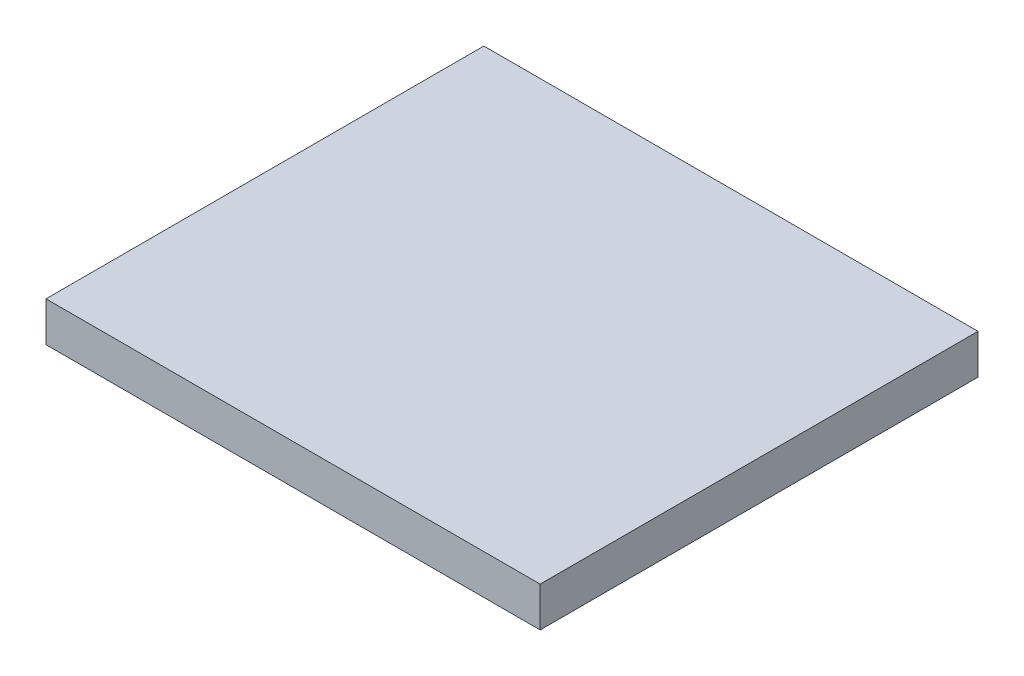
ISO-10303-21;
HEADER;
FILE_DESCRIPTION(('STEP AP214'),'2;1');
FILE_NAME('part.step','',(''),(''),'','','');
FILE_SCHEMA(('AUTOMOTIVE_DESIGN { 1 0 10303 214 1 1 1 1 }'));
ENDSEC;
DATA;
#1=APPLICATION_CONTEXT('core data for automotive mechanical design processes');
#2=APPLICATION_PROTOCOL_DEFINITION('international standard','automotive_design',2000,#1);
#3=PRODUCT_CONTEXT('',#1,'mechanical');
#4=PRODUCT('Part','Part','',(#3));
#5=PRODUCT_RELATED_PRODUCT_CATEGORY('part','',(#4));
#6=PRODUCT_DEFINITION_FORMATION('','',#4);
#7=PRODUCT_DEFINITION_CONTEXT('part definition',#1,'design');
#8=PRODUCT_DEFINITION('design','',#6,#7);
#9=PRODUCT_DEFINITION_SHAPE('','',#8);
#10=(LENGTH_UNIT() NAMED_UNIT(*) SI_UNIT(.MILLI.,.METRE.));
#11=(NAMED_UNIT(*) PLANE_ANGLE_UNIT() SI_UNIT($,.RADIAN.));
#12=(NAMED_UNIT(*) SI_UNIT($,.STERADIAN.) SOLID_ANGLE_UNIT());
#13=UNCERTAINTY_MEASURE_WITH_UNIT(LENGTH_MEASURE(1.E-05),#10,'distance_accuracy_value','');
#14=(GEOMETRIC_REPRESENTATION_CONTEXT(3) GLOBAL_UNCERTAINTY_ASSIGNED_CONTEXT((#13)) GLOBAL_UNIT_ASSIGNED_CONTEXT((#10,
#11,#12)) REPRESENTATION_CONTEXT('',''));
#15=CARTESIAN_POINT('',(0.,0.,0.));
#16=DIRECTION('',(0.,0.,1.));
#17=DIRECTION('',(1.,0.,0.));
#18=AXIS2_PLACEMENT_3D('',#15,#16,#17);
#19=CARTESIAN_POINT('',(-43.5628937256313,3.175,-5.71090549510746));
#20=DIRECTION('',(1.,0.,0.));
#21=DIRECTION('',(0.,0.,-1.));
#22=AXIS2_PLACEMENT_3D('',#19,#20,#21);
#23=PLANE('',#22);
#24=DIRECTION('',(0.,0.,1.));
#25=VECTOR('',#24,1.);
#26=CARTESIAN_POINT('',(-43.5628937256313,0.,-5.71090549510746));
#27=LINE('',#26,#25);
#28=CARTESIAN_POINT('',(-43.5628937256313,0.,-5.71090549510746));
#29=VERTEX_POINT('',#28);
#30=CARTESIAN_POINT('',(-43.5628937256313,0.,29.2890945048925));
#31=VERTEX_POINT('',#30);
#32=EDGE_CURVE('E96',#29,#31,#27,.T.);
#33=ORIENTED_EDGE('',*,*,#32,.T.);
#34=DIRECTION('',(0.,-1.,0.));
#35=VECTOR('',#34,1.);
#36=CARTESIAN_POINT('',(-43.5628937256313,3.175,29.2890945048925));
#37=LINE('',#36,#35);
#38=CARTESIAN_POINT('',(-43.5628937256313,3.175,29.2890945048925));
#39=VERTEX_POINT('',#38);
#40=EDGE_CURVE('E11',#39,#31,#37,.T.);
#41=ORIENTED_EDGE('',*,*,#40,.F.);
#42=DIRECTION('',(0.,0.,1.));
#43=VECTOR('',#42,1.);
#44=CARTESIAN_POINT('',(-43.5628937256313,3.175,-5.71090549510746));
#45=LINE('',#44,#43);
#46=CARTESIAN_POINT('',(-43.5628937256313,3.175,-5.71090549510746));
#47=VERTEX_POINT('',#46);
#48=EDGE_CURVE('E84',#47,#39,#45,.T.);
#49=ORIENTED_EDGE('',*,*,#48,.F.);
#50=DIRECTION('',(0.,-1.,0.));
#51=VECTOR('',#50,1.);
#52=CARTESIAN_POINT('',(-43.5628937256313,3.175,-5.71090549510746));
#53=LINE('',#52,#51);
#54=EDGE_CURVE('E92',#47,#29,#53,.T.);
#55=ORIENTED_EDGE('',*,*,#54,.T.);
#56=EDGE_LOOP('',(#33,#41,#49,#55));
#57=FACE_BOUND('',#56,.T.);
#58=ADVANCED_FACE('F33',(#57),#23,.F.);
#59=CARTESIAN_POINT('',(-43.5628937256313,3.175,29.2890945048925));
#60=DIRECTION('',(0.,0.,-1.));
#61=DIRECTION('',(-1.,0.,0.));
#62=AXIS2_PLACEMENT_3D('',#59,#60,#61);
#63=PLANE('',#62);
#64=DIRECTION('',(1.,0.,0.));
#65=VECTOR('',#64,1.);
#66=CARTESIAN_POINT('',(-43.5628937256313,0.,29.2890945048925));
#67=LINE('',#66,#65);
#68=CARTESIAN_POINT('',(-4.06289372563132,0.,29.2890945048925));
#69=VERTEX_POINT('',#68);
#70=EDGE_CURVE('E88',#31,#69,#67,.T.);
#71=ORIENTED_EDGE('',*,*,#70,.T.);
#72=DIRECTION('',(0.,-1.,0.));
#73=VECTOR('',#72,1.);
#74=CARTESIAN_POINT('',(-4.06289372563132,3.175,29.2890945048925));
#75=LINE('',#74,#73);
#76=CARTESIAN_POINT('',(-4.06289372563132,3.175,29.2890945048925));
#77=VERTEX_POINT('',#76);
#78=EDGE_CURVE('E41',#77,#69,#75,.T.);
#79=ORIENTED_EDGE('',*,*,#78,.F.);
#80=DIRECTION('',(1.,0.,0.));
#81=VECTOR('',#80,1.);
#82=CARTESIAN_POINT('',(-43.5628937256313,3.175,29.2890945048925));
#83=LINE('',#82,#81);
#84=EDGE_CURVE('E79',#39,#77,#83,.T.);
#85=ORIENTED_EDGE('',*,*,#84,.F.);
#86=ORIENTED_EDGE('',*,*,#40,.T.);
#87=EDGE_LOOP('',(#71,#79,#85,#86));
#88=FACE_BOUND('',#87,.T.);
#89=ADVANCED_FACE('F87',(#88),#63,.F.);
#90=CARTESIAN_POINT('',(-4.06289372563132,3.175,-5.71090549510746));
#91=DIRECTION('',(-1.,0.,0.));
#92=DIRECTION('',(0.,0.,1.));
#93=AXIS2_PLACEMENT_3D('',#90,#91,#92);
#94=PLANE('',#93);
#95=DIRECTION('',(0.,0.,-1.));
#96=VECTOR('',#95,1.);
#97=CARTESIAN_POINT('',(-4.06289372563132,0.,-5.71090549510746));
#98=LINE('',#97,#96);
#99=CARTESIAN_POINT('',(-4.06289372563132,0.,-5.71090549510746));
#100=VERTEX_POINT('',#99);
#101=EDGE_CURVE('E66',#69,#100,#98,.T.);
#102=ORIENTED_EDGE('',*,*,#101,.T.);
#103=DIRECTION('',(0.,-1.,0.));
#104=VECTOR('',#103,1.);
#105=CARTESIAN_POINT('',(-4.06289372563132,3.175,-5.71090549510746));
#106=LINE('',#105,#104);
#107=CARTESIAN_POINT('',(-4.06289372563132,3.175,-5.71090549510746));
#108=VERTEX_POINT('',#107);
#109=EDGE_CURVE('E89',#108,#100,#106,.T.);
#110=ORIENTED_EDGE('',*,*,#109,.F.);
#111=DIRECTION('',(0.,0.,-1.));
#112=VECTOR('',#111,1.);
#113=CARTESIAN_POINT('',(-4.06289372563132,3.175,-5.71090549510746));
#114=LINE('',#113,#112);
#115=EDGE_CURVE('E82',#77,#108,#114,.T.);
#116=ORIENTED_EDGE('',*,*,#115,.F.);
#117=ORIENTED_EDGE('',*,*,#78,.T.);
#118=EDGE_LOOP('',(#102,#110,#116,#117));
#119=FACE_BOUND('',#118,.T.);
#120=ADVANCED_FACE('F90',(#119),#94,.F.);
#121=CARTESIAN_POINT('',(-43.5628937256313,3.175,-5.71090549510746));
#122=DIRECTION('',(0.,0.,1.));
#123=DIRECTION('',(1.,0.,0.));
#124=AXIS2_PLACEMENT_3D('',#121,#122,#123);
#125=PLANE('',#124);
#126=DIRECTION('',(-1.,0.,0.));
#127=VECTOR('',#126,1.);
#128=CARTESIAN_POINT('',(-43.5628937256313,0.,-5.71090549510746));
#129=LINE('',#128,#127);
#130=EDGE_CURVE('E72',#100,#29,#129,.T.);
#131=ORIENTED_EDGE('',*,*,#130,.T.);
#132=ORIENTED_EDGE('',*,*,#54,.F.);
#133=DIRECTION('',(-1.,0.,0.));
#134=VECTOR('',#133,1.);
#135=CARTESIAN_POINT('',(-43.5628937256313,3.175,-5.71090549510746));
#136=LINE('',#135,#134);
#137=EDGE_CURVE('E49',#108,#47,#136,.T.);
#138=ORIENTED_EDGE('',*,*,#137,.F.);
#139=ORIENTED_EDGE('',*,*,#109,.T.);
#140=EDGE_LOOP('',(#131,#132,#138,#139));
#141=FACE_BOUND('',#140,.T.);
#142=ADVANCED_FACE('F103',(#141),#125,.F.);
#143=CARTESIAN_POINT('',(-43.5628937256313,3.175,29.2890945048925));
#144=DIRECTION('',(0.,1.,0.));
#145=DIRECTION('',(0.,0.,1.));
#146=AXIS2_PLACEMENT_3D('',#143,#144,#145);
#147=PLANE('',#146);
#148=ORIENTED_EDGE('',*,*,#48,.T.);
#149=ORIENTED_EDGE('',*,*,#84,.T.);
#150=ORIENTED_EDGE('',*,*,#115,.T.);
#151=ORIENTED_EDGE('',*,*,#137,.T.);
#152=EDGE_LOOP('',(#148,#149,#150,#151));
#153=FACE_BOUND('',#152,.T.);
#154=ADVANCED_FACE('F80',(#153),#147,.T.);
#155=CARTESIAN_POINT('',(-43.5628937256313,0.,29.2890945048925));
#156=DIRECTION('',(0.,1.,0.));
#157=DIRECTION('',(0.,0.,1.));
#158=AXIS2_PLACEMENT_3D('',#155,#156,#157);
#159=PLANE('',#158);
#160=ORIENTED_EDGE('',*,*,#32,.F.);
#161=ORIENTED_EDGE('',*,*,#130,.F.);
#162=ORIENTED_EDGE('',*,*,#101,.F.);
#163=ORIENTED_EDGE('',*,*,#70,.F.);
#164=EDGE_LOOP('',(#160,#161,#162,#163));
#165=FACE_BOUND('',#164,.T.);
#166=ADVANCED_FACE('F106',(#165),#159,.F.);
#167=CLOSED_SHELL('',(#58,#89,#120,#142,#154,#166));
#168=MANIFOLD_SOLID_BREP('B2',#167);
#169=ADVANCED_BREP_SHAPE_REPRESENTATION('',(#18,#168),#14);
#170=SHAPE_DEFINITION_REPRESENTATION(#9,#169);
ENDSEC;
END-ISO-10303-21;
